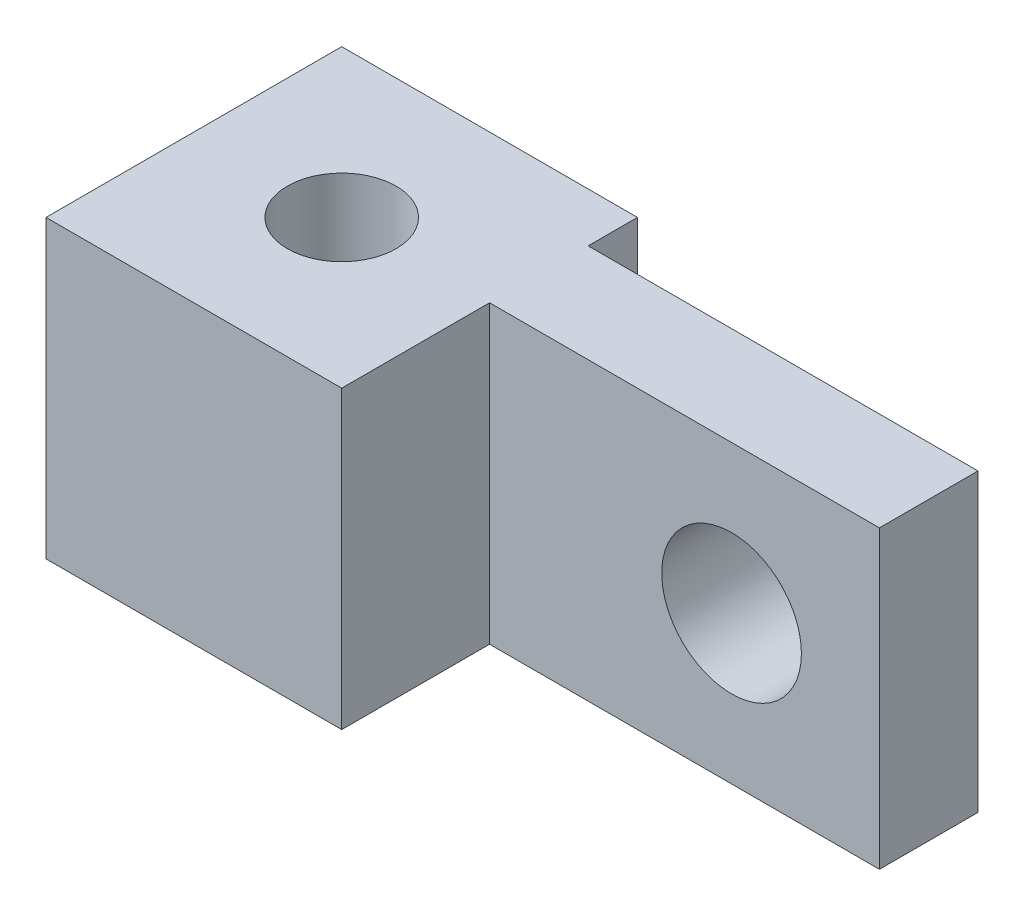
ISO-10303-21;
HEADER;
FILE_DESCRIPTION(('STEP AP214'),'2;1');
FILE_NAME('part.step','',(''),(''),'','','');
FILE_SCHEMA(('AUTOMOTIVE_DESIGN { 1 0 10303 214 1 1 1 1 }'));
ENDSEC;
DATA;
#1=APPLICATION_CONTEXT('core data for automotive mechanical design processes');
#2=APPLICATION_PROTOCOL_DEFINITION('international standard','automotive_design',2000,#1);
#3=PRODUCT_CONTEXT('',#1,'mechanical');
#4=PRODUCT('Part','Part','',(#3));
#5=PRODUCT_RELATED_PRODUCT_CATEGORY('part','',(#4));
#6=PRODUCT_DEFINITION_FORMATION('','',#4);
#7=PRODUCT_DEFINITION_CONTEXT('part definition',#1,'design');
#8=PRODUCT_DEFINITION('design','',#6,#7);
#9=PRODUCT_DEFINITION_SHAPE('','',#8);
#10=(LENGTH_UNIT() NAMED_UNIT(*) SI_UNIT(.MILLI.,.METRE.));
#11=(NAMED_UNIT(*) PLANE_ANGLE_UNIT() SI_UNIT($,.RADIAN.));
#12=(NAMED_UNIT(*) SI_UNIT($,.STERADIAN.) SOLID_ANGLE_UNIT());
#13=UNCERTAINTY_MEASURE_WITH_UNIT(LENGTH_MEASURE(1.E-05),#10,'distance_accuracy_value','');
#14=(GEOMETRIC_REPRESENTATION_CONTEXT(3) GLOBAL_UNCERTAINTY_ASSIGNED_CONTEXT((#13)) GLOBAL_UNIT_ASSIGNED_CONTEXT((#10,
#11,#12)) REPRESENTATION_CONTEXT('',''));
#15=CARTESIAN_POINT('',(0.,0.,0.));
#16=DIRECTION('',(0.,0.,1.));
#17=DIRECTION('',(1.,0.,0.));
#18=AXIS2_PLACEMENT_3D('',#15,#16,#17);
#19=CARTESIAN_POINT('',(0.,0.,6.35));
#20=DIRECTION('',(0.,0.,1.));
#21=DIRECTION('',(1.,0.,0.));
#22=AXIS2_PLACEMENT_3D('',#19,#20,#21);
#23=PLANE('',#22);
#24=CARTESIAN_POINT('',(50.8,204.55,6.35));
#25=DIRECTION('',(0.,0.,1.));
#26=DIRECTION('',(1.,0.,0.));
#27=AXIS2_PLACEMENT_3D('',#24,#25,#26);
#28=CIRCLE('',#27,4.5);
#29=CARTESIAN_POINT('',(55.3,204.55,6.35));
#30=VERTEX_POINT('',#29);
#31=EDGE_CURVE('E251',#30,#30,#28,.T.);
#32=ORIENTED_EDGE('',*,*,#31,.F.);
#33=EDGE_LOOP('',(#32));
#34=FACE_BOUND('',#33,.T.);
#35=DIRECTION('',(-1.,0.,0.));
#36=VECTOR('',#35,1.);
#37=CARTESIAN_POINT('',(16.1625000000049,214.075,6.35));
#38=LINE('',#37,#36);
#39=CARTESIAN_POINT('',(60.325,214.075,6.35));
#40=VERTEX_POINT('',#39);
#41=CARTESIAN_POINT('',(35.2125000000049,214.075,6.35));
#42=VERTEX_POINT('',#41);
#43=EDGE_CURVE('E61',#40,#42,#38,.T.);
#44=ORIENTED_EDGE('',*,*,#43,.T.);
#45=DIRECTION('',(0.,-1.,0.));
#46=VECTOR('',#45,1.);
#47=CARTESIAN_POINT('',(35.2125000000049,0.,6.35));
#48=LINE('',#47,#46);
#49=CARTESIAN_POINT('',(35.2125000000049,195.025,6.35));
#50=VERTEX_POINT('',#49);
#51=EDGE_CURVE('E65',#42,#50,#48,.T.);
#52=ORIENTED_EDGE('',*,*,#51,.T.);
#53=DIRECTION('',(1.,0.,0.));
#54=VECTOR('',#53,1.);
#55=CARTESIAN_POINT('',(16.1625000000049,195.025,6.35));
#56=LINE('',#55,#54);
#57=CARTESIAN_POINT('',(60.325,195.025,6.35));
#58=VERTEX_POINT('',#57);
#59=EDGE_CURVE('E166',#50,#58,#56,.T.);
#60=ORIENTED_EDGE('',*,*,#59,.T.);
#61=DIRECTION('',(0.,1.,0.));
#62=VECTOR('',#61,1.);
#63=CARTESIAN_POINT('',(60.325,214.075,6.35));
#64=LINE('',#63,#62);
#65=EDGE_CURVE('E169',#58,#40,#64,.T.);
#66=ORIENTED_EDGE('',*,*,#65,.T.);
#67=EDGE_LOOP('',(#44,#52,#60,#66));
#68=FACE_BOUND('',#67,.T.);
#69=ADVANCED_FACE('F45',(#34,#68),#23,.T.);
#70=CARTESIAN_POINT('',(0.,0.,0.));
#71=DIRECTION('',(0.,0.,1.));
#72=DIRECTION('',(1.,0.,0.));
#73=AXIS2_PLACEMENT_3D('',#70,#71,#72);
#74=PLANE('',#73);
#75=CARTESIAN_POINT('',(50.8,204.55,0.));
#76=DIRECTION('',(0.,0.,1.));
#77=DIRECTION('',(1.,0.,0.));
#78=AXIS2_PLACEMENT_3D('',#75,#76,#77);
#79=CIRCLE('',#78,4.5);
#80=CARTESIAN_POINT('',(55.3,204.55,0.));
#81=VERTEX_POINT('',#80);
#82=EDGE_CURVE('E246',#81,#81,#79,.T.);
#83=ORIENTED_EDGE('',*,*,#82,.T.);
#84=EDGE_LOOP('',(#83));
#85=FACE_BOUND('',#84,.T.);
#86=DIRECTION('',(0.,-1.,0.));
#87=VECTOR('',#86,1.);
#88=CARTESIAN_POINT('',(35.2125000000049,0.,0.));
#89=LINE('',#88,#87);
#90=CARTESIAN_POINT('',(35.2125000000049,214.075,0.));
#91=VERTEX_POINT('',#90);
#92=CARTESIAN_POINT('',(35.2125000000049,195.025,0.));
#93=VERTEX_POINT('',#92);
#94=EDGE_CURVE('E11',#91,#93,#89,.T.);
#95=ORIENTED_EDGE('',*,*,#94,.F.);
#96=DIRECTION('',(-1.,0.,0.));
#97=VECTOR('',#96,1.);
#98=CARTESIAN_POINT('',(16.1625000000049,214.075,0.));
#99=LINE('',#98,#97);
#100=CARTESIAN_POINT('',(60.325,214.075,0.));
#101=VERTEX_POINT('',#100);
#102=EDGE_CURVE('E170',#101,#91,#99,.T.);
#103=ORIENTED_EDGE('',*,*,#102,.F.);
#104=DIRECTION('',(0.,1.,0.));
#105=VECTOR('',#104,1.);
#106=CARTESIAN_POINT('',(60.325,214.075,0.));
#107=LINE('',#106,#105);
#108=CARTESIAN_POINT('',(60.325,195.025,0.));
#109=VERTEX_POINT('',#108);
#110=EDGE_CURVE('E178',#109,#101,#107,.T.);
#111=ORIENTED_EDGE('',*,*,#110,.F.);
#112=DIRECTION('',(1.,0.,0.));
#113=VECTOR('',#112,1.);
#114=CARTESIAN_POINT('',(16.1625000000049,195.025,0.));
#115=LINE('',#114,#113);
#116=EDGE_CURVE('E165',#93,#109,#115,.T.);
#117=ORIENTED_EDGE('',*,*,#116,.F.);
#118=EDGE_LOOP('',(#95,#103,#111,#117));
#119=FACE_BOUND('',#118,.T.);
#120=ADVANCED_FACE('F202',(#85,#119),#74,.F.);
#121=CARTESIAN_POINT('',(16.1625000000049,214.075,6.35));
#122=DIRECTION('',(1.,0.,0.));
#123=DIRECTION('',(0.,0.,-1.));
#124=AXIS2_PLACEMENT_3D('',#121,#122,#123);
#125=PLANE('',#124);
#126=DIRECTION('',(0.,0.,-1.));
#127=VECTOR('',#126,1.);
#128=CARTESIAN_POINT('',(16.1625000000049,214.075,6.35));
#129=LINE('',#128,#127);
#130=CARTESIAN_POINT('',(16.1625000000049,214.075,15.875));
#131=VERTEX_POINT('',#130);
#132=CARTESIAN_POINT('',(16.1625000000049,214.075,-3.175));
#133=VERTEX_POINT('',#132);
#134=EDGE_CURVE('E175',#131,#133,#129,.T.);
#135=ORIENTED_EDGE('',*,*,#134,.T.);
#136=DIRECTION('',(0.,-1.,0.));
#137=VECTOR('',#136,1.);
#138=CARTESIAN_POINT('',(16.1625000000049,214.075,-3.175));
#139=LINE('',#138,#137);
#140=CARTESIAN_POINT('',(16.1625000000049,195.025,-3.175));
#141=VERTEX_POINT('',#140);
#142=EDGE_CURVE('E112',#133,#141,#139,.T.);
#143=ORIENTED_EDGE('',*,*,#142,.T.);
#144=DIRECTION('',(0.,0.,-1.));
#145=VECTOR('',#144,1.);
#146=CARTESIAN_POINT('',(16.1625000000049,195.025,6.35));
#147=LINE('',#146,#145);
#148=CARTESIAN_POINT('',(16.1625000000049,195.025,15.875));
#149=VERTEX_POINT('',#148);
#150=EDGE_CURVE('E54',#149,#141,#147,.T.);
#151=ORIENTED_EDGE('',*,*,#150,.F.);
#152=DIRECTION('',(0.,-1.,0.));
#153=VECTOR('',#152,1.);
#154=CARTESIAN_POINT('',(16.1625000000049,214.075,15.875));
#155=LINE('',#154,#153);
#156=EDGE_CURVE('E110',#131,#149,#155,.T.);
#157=ORIENTED_EDGE('',*,*,#156,.F.);
#158=EDGE_LOOP('',(#135,#143,#151,#157));
#159=FACE_BOUND('',#158,.T.);
#160=ADVANCED_FACE('F47',(#159),#125,.F.);
#161=CARTESIAN_POINT('',(16.1625000000049,195.025,6.35));
#162=DIRECTION('',(0.,1.,0.));
#163=DIRECTION('',(-1.,0.,0.));
#164=AXIS2_PLACEMENT_3D('',#161,#162,#163);
#165=PLANE('',#164);
#166=CARTESIAN_POINT('',(25.6875000000049,195.025,6.35));
#167=DIRECTION('',(0.,1.,0.));
#168=DIRECTION('',(-1.,0.,0.));
#169=AXIS2_PLACEMENT_3D('',#166,#167,#168);
#170=CIRCLE('',#169,3.49999999999999);
#171=CARTESIAN_POINT('',(22.1875000000049,195.025,6.35));
#172=VERTEX_POINT('',#171);
#173=EDGE_CURVE('E140',#172,#172,#170,.T.);
#174=ORIENTED_EDGE('',*,*,#173,.T.);
#175=EDGE_LOOP('',(#174));
#176=FACE_BOUND('',#175,.T.);
#177=ORIENTED_EDGE('',*,*,#150,.T.);
#178=DIRECTION('',(1.,0.,0.));
#179=VECTOR('',#178,1.);
#180=CARTESIAN_POINT('',(16.1625000000049,195.025,-3.175));
#181=LINE('',#180,#179);
#182=CARTESIAN_POINT('',(35.2125000000049,195.025,-3.175));
#183=VERTEX_POINT('',#182);
#184=EDGE_CURVE('E150',#141,#183,#181,.T.);
#185=ORIENTED_EDGE('',*,*,#184,.T.);
#186=DIRECTION('',(0.,0.,-1.));
#187=VECTOR('',#186,1.);
#188=CARTESIAN_POINT('',(35.2125000000049,195.025,15.875));
#189=LINE('',#188,#187);
#190=EDGE_CURVE('E160',#93,#183,#189,.T.);
#191=ORIENTED_EDGE('',*,*,#190,.F.);
#192=ORIENTED_EDGE('',*,*,#116,.T.);
#193=DIRECTION('',(0.,0.,-1.));
#194=VECTOR('',#193,1.);
#195=CARTESIAN_POINT('',(60.325,195.025,6.35));
#196=LINE('',#195,#194);
#197=EDGE_CURVE('E117',#58,#109,#196,.T.);
#198=ORIENTED_EDGE('',*,*,#197,.F.);
#199=ORIENTED_EDGE('',*,*,#59,.F.);
#200=CARTESIAN_POINT('',(35.2125000000049,195.025,15.875));
#201=VERTEX_POINT('',#200);
#202=EDGE_CURVE('E122',#201,#50,#189,.T.);
#203=ORIENTED_EDGE('',*,*,#202,.F.);
#204=DIRECTION('',(1.,0.,0.));
#205=VECTOR('',#204,1.);
#206=CARTESIAN_POINT('',(16.1625000000049,195.025,15.875));
#207=LINE('',#206,#205);
#208=EDGE_CURVE('E119',#149,#201,#207,.T.);
#209=ORIENTED_EDGE('',*,*,#208,.F.);
#210=EDGE_LOOP('',(#177,#185,#191,#192,#198,#199,#203,#209));
#211=FACE_BOUND('',#210,.T.);
#212=ADVANCED_FACE('F120',(#176,#211),#165,.F.);
#213=CARTESIAN_POINT('',(60.325,214.075,6.35));
#214=DIRECTION('',(-1.,0.,0.));
#215=DIRECTION('',(0.,0.,1.));
#216=AXIS2_PLACEMENT_3D('',#213,#214,#215);
#217=PLANE('',#216);
#218=ORIENTED_EDGE('',*,*,#110,.T.);
#219=DIRECTION('',(0.,0.,-1.));
#220=VECTOR('',#219,1.);
#221=CARTESIAN_POINT('',(60.325,214.075,6.35));
#222=LINE('',#221,#220);
#223=EDGE_CURVE('E186',#40,#101,#222,.T.);
#224=ORIENTED_EDGE('',*,*,#223,.F.);
#225=ORIENTED_EDGE('',*,*,#65,.F.);
#226=ORIENTED_EDGE('',*,*,#197,.T.);
#227=EDGE_LOOP('',(#218,#224,#225,#226));
#228=FACE_BOUND('',#227,.T.);
#229=ADVANCED_FACE('F196',(#228),#217,.F.);
#230=CARTESIAN_POINT('',(16.1625000000049,214.075,6.35));
#231=DIRECTION('',(0.,-1.,0.));
#232=DIRECTION('',(1.,0.,0.));
#233=AXIS2_PLACEMENT_3D('',#230,#231,#232);
#234=PLANE('',#233);
#235=CARTESIAN_POINT('',(25.6875000000049,214.075,6.35));
#236=DIRECTION('',(0.,1.,0.));
#237=DIRECTION('',(0.,0.,1.));
#238=AXIS2_PLACEMENT_3D('',#235,#236,#237);
#239=CIRCLE('',#238,3.49999999999999);
#240=CARTESIAN_POINT('',(25.6875000000049,214.075,9.84999999999999));
#241=VERTEX_POINT('',#240);
#242=EDGE_CURVE('E243',#241,#241,#239,.T.);
#243=ORIENTED_EDGE('',*,*,#242,.F.);
#244=EDGE_LOOP('',(#243));
#245=FACE_BOUND('',#244,.T.);
#246=ORIENTED_EDGE('',*,*,#134,.F.);
#247=DIRECTION('',(-1.,0.,0.));
#248=VECTOR('',#247,1.);
#249=CARTESIAN_POINT('',(16.1625000000049,214.075,15.875));
#250=LINE('',#249,#248);
#251=CARTESIAN_POINT('',(35.2125000000049,214.075,15.875));
#252=VERTEX_POINT('',#251);
#253=EDGE_CURVE('E131',#252,#131,#250,.T.);
#254=ORIENTED_EDGE('',*,*,#253,.F.);
#255=DIRECTION('',(0.,0.,-1.));
#256=VECTOR('',#255,1.);
#257=CARTESIAN_POINT('',(35.2125000000049,214.075,15.875));
#258=LINE('',#257,#256);
#259=EDGE_CURVE('E156',#252,#42,#258,.T.);
#260=ORIENTED_EDGE('',*,*,#259,.T.);
#261=ORIENTED_EDGE('',*,*,#43,.F.);
#262=ORIENTED_EDGE('',*,*,#223,.T.);
#263=ORIENTED_EDGE('',*,*,#102,.T.);
#264=CARTESIAN_POINT('',(35.2125000000049,214.075,-3.175));
#265=VERTEX_POINT('',#264);
#266=EDGE_CURVE('E147',#91,#265,#258,.T.);
#267=ORIENTED_EDGE('',*,*,#266,.T.);
#268=DIRECTION('',(-1.,0.,0.));
#269=VECTOR('',#268,1.);
#270=CARTESIAN_POINT('',(16.1625000000049,214.075,-3.175));
#271=LINE('',#270,#269);
#272=EDGE_CURVE('E133',#265,#133,#271,.T.);
#273=ORIENTED_EDGE('',*,*,#272,.T.);
#274=EDGE_LOOP('',(#246,#254,#260,#261,#262,#263,#267,#273));
#275=FACE_BOUND('',#274,.T.);
#276=ADVANCED_FACE('F204',(#245,#275),#234,.F.);
#277=CARTESIAN_POINT('',(0.,0.,-3.175));
#278=DIRECTION('',(0.,0.,1.));
#279=DIRECTION('',(1.,0.,0.));
#280=AXIS2_PLACEMENT_3D('',#277,#278,#279);
#281=PLANE('',#280);
#282=ORIENTED_EDGE('',*,*,#142,.F.);
#283=ORIENTED_EDGE('',*,*,#272,.F.);
#284=DIRECTION('',(0.,1.,0.));
#285=VECTOR('',#284,1.);
#286=CARTESIAN_POINT('',(35.2125000000049,214.075,-3.175));
#287=LINE('',#286,#285);
#288=EDGE_CURVE('E137',#183,#265,#287,.T.);
#289=ORIENTED_EDGE('',*,*,#288,.F.);
#290=ORIENTED_EDGE('',*,*,#184,.F.);
#291=EDGE_LOOP('',(#282,#283,#289,#290));
#292=FACE_BOUND('',#291,.T.);
#293=ADVANCED_FACE('F217',(#292),#281,.F.);
#294=CARTESIAN_POINT('',(35.2125000000049,214.075,15.875));
#295=DIRECTION('',(-1.,0.,0.));
#296=DIRECTION('',(0.,0.,1.));
#297=AXIS2_PLACEMENT_3D('',#294,#295,#296);
#298=PLANE('',#297);
#299=ORIENTED_EDGE('',*,*,#266,.F.);
#300=ORIENTED_EDGE('',*,*,#94,.T.);
#301=ORIENTED_EDGE('',*,*,#190,.T.);
#302=ORIENTED_EDGE('',*,*,#288,.T.);
#303=EDGE_LOOP('',(#299,#300,#301,#302));
#304=FACE_BOUND('',#303,.T.);
#305=ADVANCED_FACE('F209',(#304),#298,.F.);
#306=ORIENTED_EDGE('',*,*,#51,.F.);
#307=ORIENTED_EDGE('',*,*,#259,.F.);
#308=DIRECTION('',(0.,1.,0.));
#309=VECTOR('',#308,1.);
#310=CARTESIAN_POINT('',(35.2125000000049,214.075,15.875));
#311=LINE('',#310,#309);
#312=EDGE_CURVE('E126',#201,#252,#311,.T.);
#313=ORIENTED_EDGE('',*,*,#312,.F.);
#314=ORIENTED_EDGE('',*,*,#202,.T.);
#315=EDGE_LOOP('',(#306,#307,#313,#314));
#316=FACE_BOUND('',#315,.T.);
#317=ADVANCED_FACE('F207',(#316),#298,.F.);
#318=CARTESIAN_POINT('',(0.,0.,15.875));
#319=DIRECTION('',(0.,0.,1.));
#320=DIRECTION('',(1.,0.,0.));
#321=AXIS2_PLACEMENT_3D('',#318,#319,#320);
#322=PLANE('',#321);
#323=ORIENTED_EDGE('',*,*,#156,.T.);
#324=ORIENTED_EDGE('',*,*,#208,.T.);
#325=ORIENTED_EDGE('',*,*,#312,.T.);
#326=ORIENTED_EDGE('',*,*,#253,.T.);
#327=EDGE_LOOP('',(#323,#324,#325,#326));
#328=FACE_BOUND('',#327,.T.);
#329=ADVANCED_FACE('F129',(#328),#322,.T.);
#330=CARTESIAN_POINT('',(25.6875000000049,214.075,6.35));
#331=DIRECTION('',(0.,1.,0.));
#332=DIRECTION('',(0.,0.,1.));
#333=AXIS2_PLACEMENT_3D('',#330,#331,#332);
#334=CYLINDRICAL_SURFACE('',#333,3.49999999999999);
#335=ORIENTED_EDGE('',*,*,#242,.T.);
#336=EDGE_LOOP('',(#335));
#337=FACE_BOUND('',#336,.T.);
#338=ORIENTED_EDGE('',*,*,#173,.F.);
#339=EDGE_LOOP('',(#338));
#340=FACE_BOUND('',#339,.T.);
#341=ADVANCED_FACE('F215',(#337,#340),#334,.F.);
#342=CARTESIAN_POINT('',(50.8,204.55,6.35));
#343=DIRECTION('',(0.,0.,1.));
#344=DIRECTION('',(1.,0.,0.));
#345=AXIS2_PLACEMENT_3D('',#342,#343,#344);
#346=CYLINDRICAL_SURFACE('',#345,4.5);
#347=ORIENTED_EDGE('',*,*,#31,.T.);
#348=EDGE_LOOP('',(#347));
#349=FACE_BOUND('',#348,.T.);
#350=ORIENTED_EDGE('',*,*,#82,.F.);
#351=EDGE_LOOP('',(#350));
#352=FACE_BOUND('',#351,.T.);
#353=ADVANCED_FACE('F257',(#349,#352),#346,.F.);
#354=CLOSED_SHELL('',(#69,#120,#160,#212,#229,#276,#293,#305,#317,#329,#341,#353));
#355=MANIFOLD_SOLID_BREP('B2',#354);
#356=ADVANCED_BREP_SHAPE_REPRESENTATION('',(#18,#355),#14);
#357=SHAPE_DEFINITION_REPRESENTATION(#9,#356);
ENDSEC;
END-ISO-10303-21;
